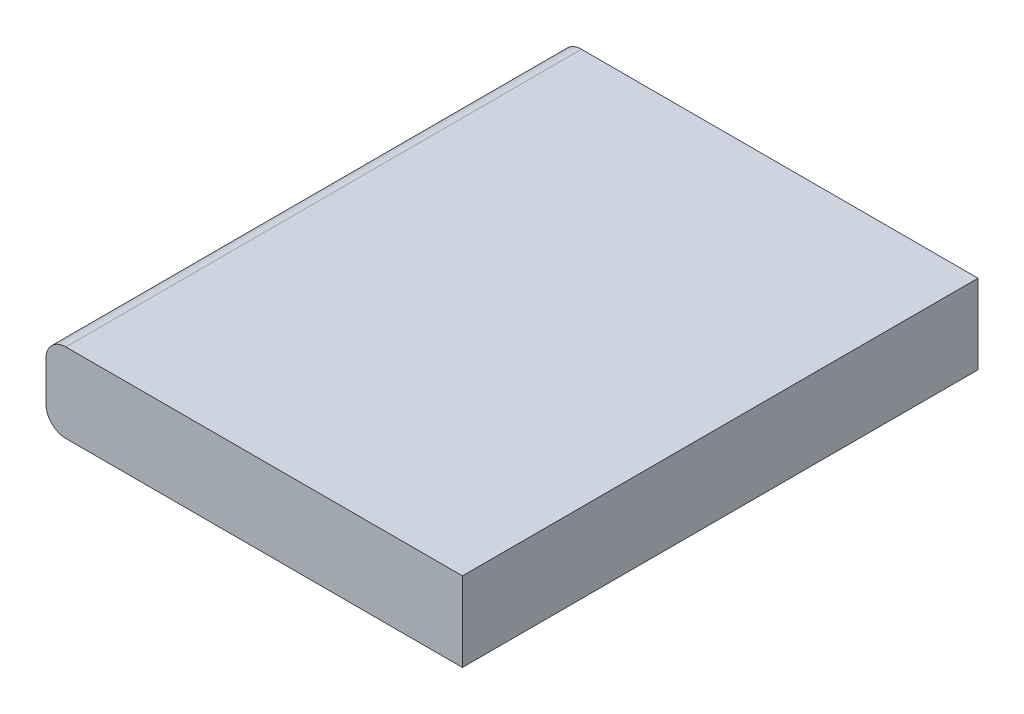
ISO-10303-21;
HEADER;
FILE_DESCRIPTION(('STEP AP214'),'2;1');
FILE_NAME('part.step','',(''),(''),'','','');
FILE_SCHEMA(('AUTOMOTIVE_DESIGN { 1 0 10303 214 1 1 1 1 }'));
ENDSEC;
DATA;
#1=APPLICATION_CONTEXT('core data for automotive mechanical design processes');
#2=APPLICATION_PROTOCOL_DEFINITION('international standard','automotive_design',2000,#1);
#3=PRODUCT_CONTEXT('',#1,'mechanical');
#4=PRODUCT('Part','Part','',(#3));
#5=PRODUCT_RELATED_PRODUCT_CATEGORY('part','',(#4));
#6=PRODUCT_DEFINITION_FORMATION('','',#4);
#7=PRODUCT_DEFINITION_CONTEXT('part definition',#1,'design');
#8=PRODUCT_DEFINITION('design','',#6,#7);
#9=PRODUCT_DEFINITION_SHAPE('','',#8);
#10=(LENGTH_UNIT() NAMED_UNIT(*) SI_UNIT(.MILLI.,.METRE.));
#11=(NAMED_UNIT(*) PLANE_ANGLE_UNIT() SI_UNIT($,.RADIAN.));
#12=(NAMED_UNIT(*) SI_UNIT($,.STERADIAN.) SOLID_ANGLE_UNIT());
#13=UNCERTAINTY_MEASURE_WITH_UNIT(LENGTH_MEASURE(1.E-05),#10,'distance_accuracy_value','');
#14=(GEOMETRIC_REPRESENTATION_CONTEXT(3) GLOBAL_UNCERTAINTY_ASSIGNED_CONTEXT((#13)) GLOBAL_UNIT_ASSIGNED_CONTEXT((#10,
#11,#12)) REPRESENTATION_CONTEXT('',''));
#15=CARTESIAN_POINT('',(0.,0.,0.));
#16=DIRECTION('',(0.,0.,1.));
#17=DIRECTION('',(1.,0.,0.));
#18=AXIS2_PLACEMENT_3D('',#15,#16,#17);
#19=CARTESIAN_POINT('',(-0.475,0.05,-0.65));
#20=DIRECTION('',(0.,0.,1.));
#21=DIRECTION('',(1.,0.,0.));
#22=AXIS2_PLACEMENT_3D('',#19,#20,#21);
#23=CYLINDRICAL_SURFACE('',#22,0.05);
#24=DIRECTION('',(0.,0.,1.));
#25=VECTOR('',#24,1.);
#26=CARTESIAN_POINT('',(-0.525,0.05,-0.65));
#27=LINE('',#26,#25);
#28=CARTESIAN_POINT('',(-0.525,0.05,-0.65));
#29=VERTEX_POINT('',#28);
#30=CARTESIAN_POINT('',(-0.525,0.05,0.65));
#31=VERTEX_POINT('',#30);
#32=EDGE_CURVE('E125',#29,#31,#27,.T.);
#33=ORIENTED_EDGE('',*,*,#32,.F.);
#34=CARTESIAN_POINT('',(-0.475,0.05,-0.65));
#35=DIRECTION('',(0.,0.,1.));
#36=DIRECTION('',(1.,0.,0.));
#37=AXIS2_PLACEMENT_3D('',#34,#35,#36);
#38=CIRCLE('',#37,0.05);
#39=CARTESIAN_POINT('',(-0.475,0.,-0.65));
#40=VERTEX_POINT('',#39);
#41=EDGE_CURVE('E42',#40,#29,#38,.F.);
#42=ORIENTED_EDGE('',*,*,#41,.F.);
#43=DIRECTION('',(0.,0.,1.));
#44=VECTOR('',#43,1.);
#45=CARTESIAN_POINT('',(-0.475,0.,0.));
#46=LINE('',#45,#44);
#47=CARTESIAN_POINT('',(-0.475,0.,0.65));
#48=VERTEX_POINT('',#47);
#49=EDGE_CURVE('E128',#48,#40,#46,.F.);
#50=ORIENTED_EDGE('',*,*,#49,.F.);
#51=CARTESIAN_POINT('',(-0.475,0.05,0.65));
#52=DIRECTION('',(0.,0.,-1.));
#53=DIRECTION('',(-1.,0.,0.));
#54=AXIS2_PLACEMENT_3D('',#51,#52,#53);
#55=CIRCLE('',#54,0.05);
#56=EDGE_CURVE('E11',#31,#48,#55,.F.);
#57=ORIENTED_EDGE('',*,*,#56,.F.);
#58=EDGE_LOOP('',(#33,#42,#50,#57));
#59=FACE_BOUND('',#58,.T.);
#60=ADVANCED_FACE('F35',(#59),#23,.T.);
#61=CARTESIAN_POINT('',(-0.475,0.15,-0.65));
#62=DIRECTION('',(0.,0.,1.));
#63=DIRECTION('',(1.,0.,0.));
#64=AXIS2_PLACEMENT_3D('',#61,#62,#63);
#65=CYLINDRICAL_SURFACE('',#64,0.05);
#66=DIRECTION('',(0.,0.,-1.));
#67=VECTOR('',#66,1.);
#68=CARTESIAN_POINT('',(-0.525,0.15,-0.65));
#69=LINE('',#68,#67);
#70=CARTESIAN_POINT('',(-0.525,0.15,0.65));
#71=VERTEX_POINT('',#70);
#72=CARTESIAN_POINT('',(-0.525,0.15,-0.65));
#73=VERTEX_POINT('',#72);
#74=EDGE_CURVE('E110',#71,#73,#69,.T.);
#75=ORIENTED_EDGE('',*,*,#74,.F.);
#76=CARTESIAN_POINT('',(-0.475,0.15,0.65));
#77=DIRECTION('',(0.,0.,-1.));
#78=DIRECTION('',(-1.,0.,0.));
#79=AXIS2_PLACEMENT_3D('',#76,#77,#78);
#80=CIRCLE('',#79,0.05);
#81=CARTESIAN_POINT('',(-0.475,0.2,0.65));
#82=VERTEX_POINT('',#81);
#83=EDGE_CURVE('E122',#82,#71,#80,.F.);
#84=ORIENTED_EDGE('',*,*,#83,.F.);
#85=DIRECTION('',(0.,0.,-1.));
#86=VECTOR('',#85,1.);
#87=CARTESIAN_POINT('',(-0.475,0.2,-0.65));
#88=LINE('',#87,#86);
#89=CARTESIAN_POINT('',(-0.475,0.2,-0.65));
#90=VERTEX_POINT('',#89);
#91=EDGE_CURVE('E114',#90,#82,#88,.F.);
#92=ORIENTED_EDGE('',*,*,#91,.F.);
#93=CARTESIAN_POINT('',(-0.475,0.15,-0.65));
#94=DIRECTION('',(0.,0.,1.));
#95=DIRECTION('',(1.,0.,0.));
#96=AXIS2_PLACEMENT_3D('',#93,#94,#95);
#97=CIRCLE('',#96,0.05);
#98=EDGE_CURVE('E92',#73,#90,#97,.F.);
#99=ORIENTED_EDGE('',*,*,#98,.F.);
#100=EDGE_LOOP('',(#75,#84,#92,#99));
#101=FACE_BOUND('',#100,.T.);
#102=ADVANCED_FACE('F135',(#101),#65,.T.);
#103=CARTESIAN_POINT('',(0.525,0.2,-0.65));
#104=DIRECTION('',(-1.,0.,0.));
#105=DIRECTION('',(0.,0.,1.));
#106=AXIS2_PLACEMENT_3D('',#103,#104,#105);
#107=PLANE('',#106);
#108=DIRECTION('',(0.,0.,-1.));
#109=VECTOR('',#108,1.);
#110=CARTESIAN_POINT('',(0.525,0.,-0.65));
#111=LINE('',#110,#109);
#112=CARTESIAN_POINT('',(0.525,0.,0.65));
#113=VERTEX_POINT('',#112);
#114=CARTESIAN_POINT('',(0.525,0.,-0.65));
#115=VERTEX_POINT('',#114);
#116=EDGE_CURVE('E109',#113,#115,#111,.T.);
#117=ORIENTED_EDGE('',*,*,#116,.T.);
#118=DIRECTION('',(0.,-1.,0.));
#119=VECTOR('',#118,1.);
#120=CARTESIAN_POINT('',(0.525,0.2,-0.65));
#121=LINE('',#120,#119);
#122=CARTESIAN_POINT('',(0.525,0.2,-0.65));
#123=VERTEX_POINT('',#122);
#124=EDGE_CURVE('E89',#123,#115,#121,.T.);
#125=ORIENTED_EDGE('',*,*,#124,.F.);
#126=DIRECTION('',(0.,0.,-1.));
#127=VECTOR('',#126,1.);
#128=CARTESIAN_POINT('',(0.525,0.2,-0.65));
#129=LINE('',#128,#127);
#130=CARTESIAN_POINT('',(0.525,0.2,0.65));
#131=VERTEX_POINT('',#130);
#132=EDGE_CURVE('E97',#131,#123,#129,.T.);
#133=ORIENTED_EDGE('',*,*,#132,.F.);
#134=DIRECTION('',(0.,-1.,0.));
#135=VECTOR('',#134,1.);
#136=CARTESIAN_POINT('',(0.525,0.2,0.65));
#137=LINE('',#136,#135);
#138=EDGE_CURVE('E137',#131,#113,#137,.T.);
#139=ORIENTED_EDGE('',*,*,#138,.T.);
#140=EDGE_LOOP('',(#117,#125,#133,#139));
#141=FACE_BOUND('',#140,.T.);
#142=ADVANCED_FACE('F107',(#141),#107,.F.);
#143=CARTESIAN_POINT('',(-0.525,0.2,-0.65));
#144=DIRECTION('',(0.,0.,1.));
#145=DIRECTION('',(1.,0.,0.));
#146=AXIS2_PLACEMENT_3D('',#143,#144,#145);
#147=PLANE('',#146);
#148=DIRECTION('',(-1.,0.,0.));
#149=VECTOR('',#148,1.);
#150=CARTESIAN_POINT('',(-0.525,0.,-0.65));
#151=LINE('',#150,#149);
#152=EDGE_CURVE('E129',#115,#40,#151,.T.);
#153=ORIENTED_EDGE('',*,*,#152,.T.);
#154=ORIENTED_EDGE('',*,*,#41,.T.);
#155=DIRECTION('',(0.,-1.,0.));
#156=VECTOR('',#155,1.);
#157=CARTESIAN_POINT('',(-0.525,0.2,-0.65));
#158=LINE('',#157,#156);
#159=EDGE_CURVE('E111',#73,#29,#158,.T.);
#160=ORIENTED_EDGE('',*,*,#159,.F.);
#161=ORIENTED_EDGE('',*,*,#98,.T.);
#162=DIRECTION('',(-1.,0.,0.));
#163=VECTOR('',#162,1.);
#164=CARTESIAN_POINT('',(-0.525,0.2,-0.65));
#165=LINE('',#164,#163);
#166=EDGE_CURVE('E84',#123,#90,#165,.T.);
#167=ORIENTED_EDGE('',*,*,#166,.F.);
#168=ORIENTED_EDGE('',*,*,#124,.T.);
#169=EDGE_LOOP('',(#153,#154,#160,#161,#167,#168));
#170=FACE_BOUND('',#169,.T.);
#171=ADVANCED_FACE('F87',(#170),#147,.F.);
#172=CARTESIAN_POINT('',(-0.525,0.2,-0.65));
#173=DIRECTION('',(1.,0.,0.));
#174=DIRECTION('',(0.,0.,-1.));
#175=AXIS2_PLACEMENT_3D('',#172,#173,#174);
#176=PLANE('',#175);
#177=ORIENTED_EDGE('',*,*,#159,.T.);
#178=ORIENTED_EDGE('',*,*,#32,.T.);
#179=DIRECTION('',(0.,-1.,0.));
#180=VECTOR('',#179,1.);
#181=CARTESIAN_POINT('',(-0.525,0.2,0.65));
#182=LINE('',#181,#180);
#183=EDGE_CURVE('E117',#71,#31,#182,.T.);
#184=ORIENTED_EDGE('',*,*,#183,.F.);
#185=ORIENTED_EDGE('',*,*,#74,.T.);
#186=EDGE_LOOP('',(#177,#178,#184,#185));
#187=FACE_BOUND('',#186,.T.);
#188=ADVANCED_FACE('F132',(#187),#176,.F.);
#189=CARTESIAN_POINT('',(-0.525,0.2,0.65));
#190=DIRECTION('',(0.,0.,-1.));
#191=DIRECTION('',(-1.,0.,0.));
#192=AXIS2_PLACEMENT_3D('',#189,#190,#191);
#193=PLANE('',#192);
#194=ORIENTED_EDGE('',*,*,#183,.T.);
#195=ORIENTED_EDGE('',*,*,#56,.T.);
#196=DIRECTION('',(1.,0.,0.));
#197=VECTOR('',#196,1.);
#198=CARTESIAN_POINT('',(-0.525,0.,0.65));
#199=LINE('',#198,#197);
#200=EDGE_CURVE('E105',#48,#113,#199,.T.);
#201=ORIENTED_EDGE('',*,*,#200,.T.);
#202=ORIENTED_EDGE('',*,*,#138,.F.);
#203=DIRECTION('',(1.,0.,0.));
#204=VECTOR('',#203,1.);
#205=CARTESIAN_POINT('',(-0.525,0.2,0.65));
#206=LINE('',#205,#204);
#207=EDGE_CURVE('E96',#82,#131,#206,.T.);
#208=ORIENTED_EDGE('',*,*,#207,.F.);
#209=ORIENTED_EDGE('',*,*,#83,.T.);
#210=EDGE_LOOP('',(#194,#195,#201,#202,#208,#209));
#211=FACE_BOUND('',#210,.T.);
#212=ADVANCED_FACE('F136',(#211),#193,.F.);
#213=CARTESIAN_POINT('',(0.,0.2,0.));
#214=DIRECTION('',(0.,1.,0.));
#215=DIRECTION('',(0.,0.,1.));
#216=AXIS2_PLACEMENT_3D('',#213,#214,#215);
#217=PLANE('',#216);
#218=ORIENTED_EDGE('',*,*,#166,.T.);
#219=ORIENTED_EDGE('',*,*,#91,.T.);
#220=ORIENTED_EDGE('',*,*,#207,.T.);
#221=ORIENTED_EDGE('',*,*,#132,.T.);
#222=EDGE_LOOP('',(#218,#219,#220,#221));
#223=FACE_BOUND('',#222,.T.);
#224=ADVANCED_FACE('F100',(#223),#217,.T.);
#225=CARTESIAN_POINT('',(0.,0.,0.));
#226=DIRECTION('',(0.,1.,0.));
#227=DIRECTION('',(0.,0.,1.));
#228=AXIS2_PLACEMENT_3D('',#225,#226,#227);
#229=PLANE('',#228);
#230=ORIENTED_EDGE('',*,*,#200,.F.);
#231=ORIENTED_EDGE('',*,*,#49,.T.);
#232=ORIENTED_EDGE('',*,*,#152,.F.);
#233=ORIENTED_EDGE('',*,*,#116,.F.);
#234=EDGE_LOOP('',(#230,#231,#232,#233));
#235=FACE_BOUND('',#234,.T.);
#236=ADVANCED_FACE('F145',(#235),#229,.F.);
#237=CLOSED_SHELL('',(#60,#102,#142,#171,#188,#212,#224,#236));
#238=MANIFOLD_SOLID_BREP('B2',#237);
#239=ADVANCED_BREP_SHAPE_REPRESENTATION('',(#18,#238),#14);
#240=SHAPE_DEFINITION_REPRESENTATION(#9,#239);
ENDSEC;
END-ISO-10303-21;
